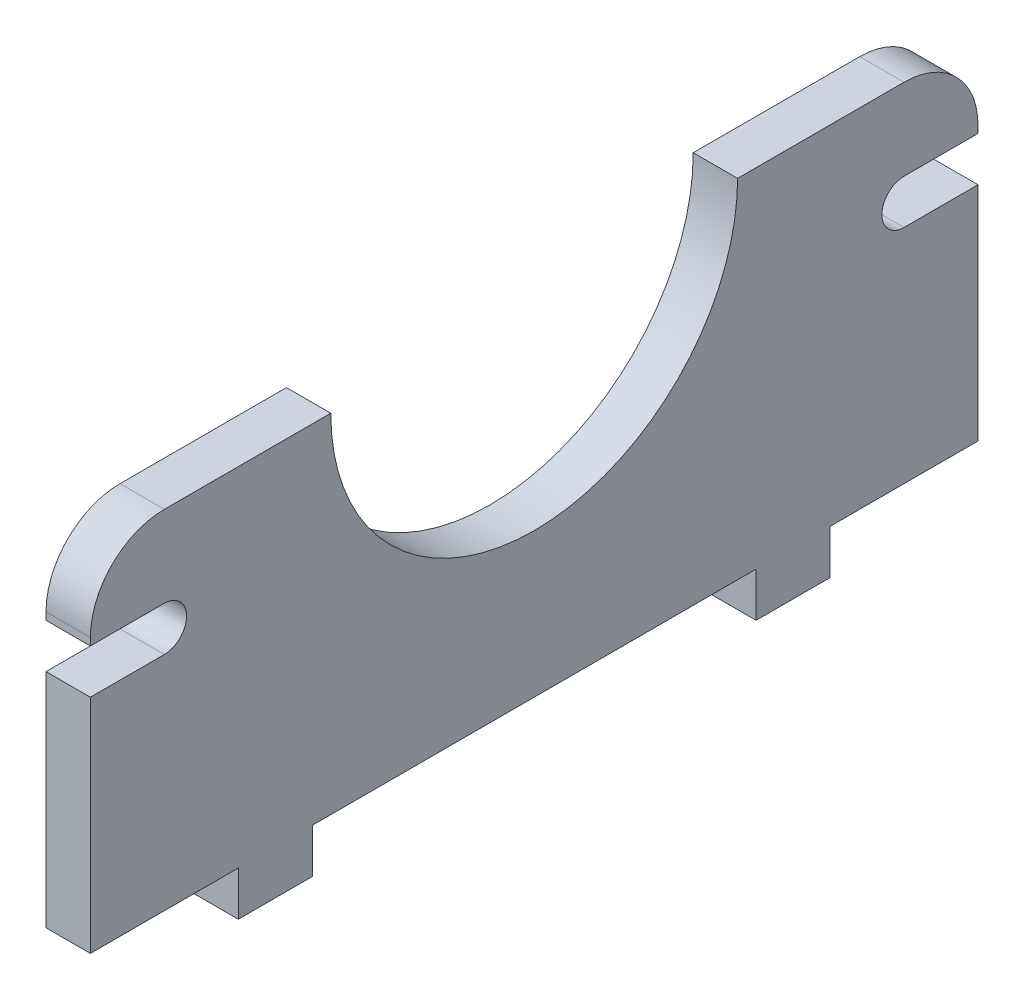
ISO-10303-21;
HEADER;
FILE_DESCRIPTION(('STEP AP214'),'2;1');
FILE_NAME('part.step','',(''),(''),'','','');
FILE_SCHEMA(('AUTOMOTIVE_DESIGN { 1 0 10303 214 1 1 1 1 }'));
ENDSEC;
DATA;
#1=APPLICATION_CONTEXT('core data for automotive mechanical design processes');
#2=APPLICATION_PROTOCOL_DEFINITION('international standard','automotive_design',2000,#1);
#3=PRODUCT_CONTEXT('',#1,'mechanical');
#4=PRODUCT('Part','Part','',(#3));
#5=PRODUCT_RELATED_PRODUCT_CATEGORY('part','',(#4));
#6=PRODUCT_DEFINITION_FORMATION('','',#4);
#7=PRODUCT_DEFINITION_CONTEXT('part definition',#1,'design');
#8=PRODUCT_DEFINITION('design','',#6,#7);
#9=PRODUCT_DEFINITION_SHAPE('','',#8);
#10=(LENGTH_UNIT() NAMED_UNIT(*) SI_UNIT(.MILLI.,.METRE.));
#11=(NAMED_UNIT(*) PLANE_ANGLE_UNIT() SI_UNIT($,.RADIAN.));
#12=(NAMED_UNIT(*) SI_UNIT($,.STERADIAN.) SOLID_ANGLE_UNIT());
#13=UNCERTAINTY_MEASURE_WITH_UNIT(LENGTH_MEASURE(1.E-05),#10,'distance_accuracy_value','');
#14=(GEOMETRIC_REPRESENTATION_CONTEXT(3) GLOBAL_UNCERTAINTY_ASSIGNED_CONTEXT((#13)) GLOBAL_UNIT_ASSIGNED_CONTEXT((#10,
#11,#12)) REPRESENTATION_CONTEXT('',''));
#15=CARTESIAN_POINT('',(0.,0.,0.));
#16=DIRECTION('',(0.,0.,1.));
#17=DIRECTION('',(1.,0.,0.));
#18=AXIS2_PLACEMENT_3D('',#15,#16,#17);
#19=CARTESIAN_POINT('',(3.,-11.75,-30.));
#20=DIRECTION('',(0.,1.,0.));
#21=DIRECTION('',(0.,0.,1.));
#22=AXIS2_PLACEMENT_3D('',#19,#20,#21);
#23=PLANE('',#22);
#24=DIRECTION('',(0.,0.,-1.));
#25=VECTOR('',#24,1.);
#26=CARTESIAN_POINT('',(0.,-11.75,-30.));
#27=LINE('',#26,#25);
#28=CARTESIAN_POINT('',(0.,-11.75,15.));
#29=VERTEX_POINT('',#28);
#30=CARTESIAN_POINT('',(0.,-11.75,-15.));
#31=VERTEX_POINT('',#30);
#32=EDGE_CURVE('E339',#29,#31,#27,.T.);
#33=ORIENTED_EDGE('',*,*,#32,.T.);
#34=DIRECTION('',(1.,0.,0.));
#35=VECTOR('',#34,1.);
#36=CARTESIAN_POINT('',(3.,-11.75,-15.));
#37=LINE('',#36,#35);
#38=CARTESIAN_POINT('',(3.,-11.75,-15.));
#39=VERTEX_POINT('',#38);
#40=EDGE_CURVE('E61',#31,#39,#37,.T.);
#41=ORIENTED_EDGE('',*,*,#40,.T.);
#42=DIRECTION('',(0.,0.,-1.));
#43=VECTOR('',#42,1.);
#44=CARTESIAN_POINT('',(3.,-11.75,-30.));
#45=LINE('',#44,#43);
#46=CARTESIAN_POINT('',(3.,-11.75,15.));
#47=VERTEX_POINT('',#46);
#48=EDGE_CURVE('E206',#47,#39,#45,.T.);
#49=ORIENTED_EDGE('',*,*,#48,.F.);
#50=DIRECTION('',(1.,0.,0.));
#51=VECTOR('',#50,1.);
#52=CARTESIAN_POINT('',(3.,-11.75,15.));
#53=LINE('',#52,#51);
#54=EDGE_CURVE('E241',#29,#47,#53,.T.);
#55=ORIENTED_EDGE('',*,*,#54,.F.);
#56=EDGE_LOOP('',(#33,#41,#49,#55));
#57=FACE_BOUND('',#56,.T.);
#58=ADVANCED_FACE('F38',(#57),#23,.F.);
#59=CARTESIAN_POINT('',(3.,-11.75,-20.));
#60=VERTEX_POINT('',#59);
#61=CARTESIAN_POINT('',(3.,-11.75,-30.));
#62=VERTEX_POINT('',#61);
#63=EDGE_CURVE('E53',#60,#62,#45,.T.);
#64=ORIENTED_EDGE('',*,*,#63,.F.);
#65=DIRECTION('',(-1.,0.,0.));
#66=VECTOR('',#65,1.);
#67=CARTESIAN_POINT('',(3.,-11.75,-20.));
#68=LINE('',#67,#66);
#69=CARTESIAN_POINT('',(0.,-11.75,-20.));
#70=VERTEX_POINT('',#69);
#71=EDGE_CURVE('E220',#60,#70,#68,.T.);
#72=ORIENTED_EDGE('',*,*,#71,.T.);
#73=CARTESIAN_POINT('',(0.,-11.75,-30.));
#74=VERTEX_POINT('',#73);
#75=EDGE_CURVE('E335',#70,#74,#27,.T.);
#76=ORIENTED_EDGE('',*,*,#75,.T.);
#77=DIRECTION('',(-1.,0.,0.));
#78=VECTOR('',#77,1.);
#79=CARTESIAN_POINT('',(3.,-11.75,-30.));
#80=LINE('',#79,#78);
#81=EDGE_CURVE('E355',#62,#74,#80,.T.);
#82=ORIENTED_EDGE('',*,*,#81,.F.);
#83=EDGE_LOOP('',(#64,#72,#76,#82));
#84=FACE_BOUND('',#83,.T.);
#85=ADVANCED_FACE('F432',(#84),#23,.F.);
#86=DIRECTION('',(-1.,0.,0.));
#87=VECTOR('',#86,1.);
#88=CARTESIAN_POINT('',(3.,-11.75,20.));
#89=LINE('',#88,#87);
#90=CARTESIAN_POINT('',(3.,-11.75,20.));
#91=VERTEX_POINT('',#90);
#92=CARTESIAN_POINT('',(0.,-11.75,20.));
#93=VERTEX_POINT('',#92);
#94=EDGE_CURVE('E209',#91,#93,#89,.T.);
#95=ORIENTED_EDGE('',*,*,#94,.F.);
#96=CARTESIAN_POINT('',(3.,-11.75,30.));
#97=VERTEX_POINT('',#96);
#98=EDGE_CURVE('E318',#97,#91,#45,.T.);
#99=ORIENTED_EDGE('',*,*,#98,.F.);
#100=DIRECTION('',(-1.,0.,0.));
#101=VECTOR('',#100,1.);
#102=CARTESIAN_POINT('',(3.,-11.75,30.));
#103=LINE('',#102,#101);
#104=CARTESIAN_POINT('',(0.,-11.75,30.));
#105=VERTEX_POINT('',#104);
#106=EDGE_CURVE('E358',#97,#105,#103,.T.);
#107=ORIENTED_EDGE('',*,*,#106,.T.);
#108=EDGE_CURVE('E336',#105,#93,#27,.T.);
#109=ORIENTED_EDGE('',*,*,#108,.T.);
#110=EDGE_LOOP('',(#95,#99,#107,#109));
#111=FACE_BOUND('',#110,.T.);
#112=ADVANCED_FACE('F449',(#111),#23,.F.);
#113=CARTESIAN_POINT('',(3.,-11.75,-30.));
#114=DIRECTION('',(0.,0.,1.));
#115=DIRECTION('',(1.,0.,0.));
#116=AXIS2_PLACEMENT_3D('',#113,#114,#115);
#117=PLANE('',#116);
#118=DIRECTION('',(0.,1.,0.));
#119=VECTOR('',#118,1.);
#120=CARTESIAN_POINT('',(0.,-11.75,-30.));
#121=LINE('',#120,#119);
#122=CARTESIAN_POINT('',(0.,6.25,-30.));
#123=VERTEX_POINT('',#122);
#124=CARTESIAN_POINT('',(0.,6.75,-30.));
#125=VERTEX_POINT('',#124);
#126=EDGE_CURVE('E338',#123,#125,#121,.T.);
#127=ORIENTED_EDGE('',*,*,#126,.T.);
#128=DIRECTION('',(-1.,0.,0.));
#129=VECTOR('',#128,1.);
#130=CARTESIAN_POINT('',(3.,6.75,-30.));
#131=LINE('',#130,#129);
#132=CARTESIAN_POINT('',(3.,6.75,-30.));
#133=VERTEX_POINT('',#132);
#134=EDGE_CURVE('E368',#125,#133,#131,.F.);
#135=ORIENTED_EDGE('',*,*,#134,.T.);
#136=DIRECTION('',(0.,1.,0.));
#137=VECTOR('',#136,1.);
#138=CARTESIAN_POINT('',(3.,-11.75,-30.));
#139=LINE('',#138,#137);
#140=CARTESIAN_POINT('',(3.,6.25,-30.));
#141=VERTEX_POINT('',#140);
#142=EDGE_CURVE('E321',#141,#133,#139,.T.);
#143=ORIENTED_EDGE('',*,*,#142,.F.);
#144=DIRECTION('',(1.,0.,0.));
#145=VECTOR('',#144,1.);
#146=CARTESIAN_POINT('',(0.,6.25,-30.));
#147=LINE('',#146,#145);
#148=EDGE_CURVE('E282',#123,#141,#147,.T.);
#149=ORIENTED_EDGE('',*,*,#148,.F.);
#150=EDGE_LOOP('',(#127,#135,#143,#149));
#151=FACE_BOUND('',#150,.T.);
#152=ADVANCED_FACE('F416',(#151),#117,.F.);
#153=DIRECTION('',(1.,0.,0.));
#154=VECTOR('',#153,1.);
#155=CARTESIAN_POINT('',(0.,3.25,-30.));
#156=LINE('',#155,#154);
#157=CARTESIAN_POINT('',(0.,3.25,-30.));
#158=VERTEX_POINT('',#157);
#159=CARTESIAN_POINT('',(3.,3.25,-30.));
#160=VERTEX_POINT('',#159);
#161=EDGE_CURVE('E284',#158,#160,#156,.T.);
#162=ORIENTED_EDGE('',*,*,#161,.T.);
#163=EDGE_CURVE('E322',#62,#160,#139,.T.);
#164=ORIENTED_EDGE('',*,*,#163,.F.);
#165=ORIENTED_EDGE('',*,*,#81,.T.);
#166=EDGE_CURVE('E340',#74,#158,#121,.T.);
#167=ORIENTED_EDGE('',*,*,#166,.T.);
#168=EDGE_LOOP('',(#162,#164,#165,#167));
#169=FACE_BOUND('',#168,.T.);
#170=ADVANCED_FACE('F430',(#169),#117,.F.);
#171=CARTESIAN_POINT('',(3.,11.75,0.));
#172=DIRECTION('',(1.,0.,0.));
#173=DIRECTION('',(0.,0.,-1.));
#174=AXIS2_PLACEMENT_3D('',#171,#172,#173);
#175=PLANE('',#174);
#176=ORIENTED_EDGE('',*,*,#142,.T.);
#177=CARTESIAN_POINT('',(3.,6.75,-25.));
#178=DIRECTION('',(1.,0.,0.));
#179=DIRECTION('',(0.,0.,-1.));
#180=AXIS2_PLACEMENT_3D('',#177,#178,#179);
#181=CIRCLE('',#180,5.);
#182=CARTESIAN_POINT('',(3.,11.75,-25.));
#183=VERTEX_POINT('',#182);
#184=EDGE_CURVE('E372',#133,#183,#181,.T.);
#185=ORIENTED_EDGE('',*,*,#184,.T.);
#186=DIRECTION('',(0.,0.,1.));
#187=VECTOR('',#186,1.);
#188=CARTESIAN_POINT('',(3.,11.75,-30.));
#189=LINE('',#188,#187);
#190=CARTESIAN_POINT('',(3.,11.75,-13.75));
#191=VERTEX_POINT('',#190);
#192=EDGE_CURVE('E325',#183,#191,#189,.T.);
#193=ORIENTED_EDGE('',*,*,#192,.T.);
#194=CARTESIAN_POINT('',(3.,11.75,0.));
#195=DIRECTION('',(-1.,0.,0.));
#196=DIRECTION('',(0.,0.,-1.));
#197=AXIS2_PLACEMENT_3D('',#194,#195,#196);
#198=CIRCLE('',#197,13.75);
#199=CARTESIAN_POINT('',(3.,11.75,13.75));
#200=VERTEX_POINT('',#199);
#201=EDGE_CURVE('E327',#191,#200,#198,.T.);
#202=ORIENTED_EDGE('',*,*,#201,.T.);
#203=DIRECTION('',(0.,0.,1.));
#204=VECTOR('',#203,1.);
#205=CARTESIAN_POINT('',(3.,11.75,13.75));
#206=LINE('',#205,#204);
#207=CARTESIAN_POINT('',(3.,11.75,25.));
#208=VERTEX_POINT('',#207);
#209=EDGE_CURVE('E329',#200,#208,#206,.T.);
#210=ORIENTED_EDGE('',*,*,#209,.T.);
#211=CARTESIAN_POINT('',(3.,6.75,25.));
#212=DIRECTION('',(1.,0.,0.));
#213=DIRECTION('',(0.,0.,-1.));
#214=AXIS2_PLACEMENT_3D('',#211,#212,#213);
#215=CIRCLE('',#214,5.);
#216=CARTESIAN_POINT('',(3.,6.75,30.));
#217=VERTEX_POINT('',#216);
#218=EDGE_CURVE('E370',#208,#217,#215,.T.);
#219=ORIENTED_EDGE('',*,*,#218,.T.);
#220=DIRECTION('',(0.,-1.,0.));
#221=VECTOR('',#220,1.);
#222=CARTESIAN_POINT('',(3.,-11.75,30.));
#223=LINE('',#222,#221);
#224=CARTESIAN_POINT('',(3.,6.25,30.));
#225=VERTEX_POINT('',#224);
#226=EDGE_CURVE('E315',#217,#225,#223,.T.);
#227=ORIENTED_EDGE('',*,*,#226,.T.);
#228=DIRECTION('',(0.,0.,1.));
#229=VECTOR('',#228,1.);
#230=CARTESIAN_POINT('',(3.,6.25,25.));
#231=LINE('',#230,#229);
#232=CARTESIAN_POINT('',(3.,6.25,25.));
#233=VERTEX_POINT('',#232);
#234=EDGE_CURVE('E301',#233,#225,#231,.T.);
#235=ORIENTED_EDGE('',*,*,#234,.F.);
#236=CARTESIAN_POINT('',(3.,4.75,25.));
#237=DIRECTION('',(1.,0.,0.));
#238=DIRECTION('',(0.,0.,-1.));
#239=AXIS2_PLACEMENT_3D('',#236,#237,#238);
#240=CIRCLE('',#239,1.5);
#241=CARTESIAN_POINT('',(3.,3.25,25.));
#242=VERTEX_POINT('',#241);
#243=EDGE_CURVE('E281',#242,#233,#240,.T.);
#244=ORIENTED_EDGE('',*,*,#243,.F.);
#245=DIRECTION('',(0.,0.,-1.));
#246=VECTOR('',#245,1.);
#247=CARTESIAN_POINT('',(3.,3.25,25.));
#248=LINE('',#247,#246);
#249=CARTESIAN_POINT('',(3.,3.25,30.));
#250=VERTEX_POINT('',#249);
#251=EDGE_CURVE('E292',#250,#242,#248,.T.);
#252=ORIENTED_EDGE('',*,*,#251,.F.);
#253=EDGE_CURVE('E317',#250,#97,#223,.T.);
#254=ORIENTED_EDGE('',*,*,#253,.T.);
#255=ORIENTED_EDGE('',*,*,#98,.T.);
#256=DIRECTION('',(0.,1.,0.));
#257=VECTOR('',#256,1.);
#258=CARTESIAN_POINT('',(3.,-14.75,20.));
#259=LINE('',#258,#257);
#260=CARTESIAN_POINT('',(3.,-14.75,20.));
#261=VERTEX_POINT('',#260);
#262=EDGE_CURVE('E259',#261,#91,#259,.T.);
#263=ORIENTED_EDGE('',*,*,#262,.F.);
#264=DIRECTION('',(0.,0.,1.));
#265=VECTOR('',#264,1.);
#266=CARTESIAN_POINT('',(3.,-14.75,20.));
#267=LINE('',#266,#265);
#268=CARTESIAN_POINT('',(3.,-14.75,15.));
#269=VERTEX_POINT('',#268);
#270=EDGE_CURVE('E237',#269,#261,#267,.T.);
#271=ORIENTED_EDGE('',*,*,#270,.F.);
#272=DIRECTION('',(0.,1.,0.));
#273=VECTOR('',#272,1.);
#274=CARTESIAN_POINT('',(3.,-14.75,15.));
#275=LINE('',#274,#273);
#276=EDGE_CURVE('E247',#269,#47,#275,.T.);
#277=ORIENTED_EDGE('',*,*,#276,.T.);
#278=ORIENTED_EDGE('',*,*,#48,.T.);
#279=DIRECTION('',(0.,1.,0.));
#280=VECTOR('',#279,1.);
#281=CARTESIAN_POINT('',(3.,-14.75,-15.));
#282=LINE('',#281,#280);
#283=CARTESIAN_POINT('',(3.,-14.75,-15.));
#284=VERTEX_POINT('',#283);
#285=EDGE_CURVE('E199',#284,#39,#282,.T.);
#286=ORIENTED_EDGE('',*,*,#285,.F.);
#287=DIRECTION('',(0.,0.,-1.));
#288=VECTOR('',#287,1.);
#289=CARTESIAN_POINT('',(3.,-14.75,-20.));
#290=LINE('',#289,#288);
#291=CARTESIAN_POINT('',(3.,-14.75,-20.));
#292=VERTEX_POINT('',#291);
#293=EDGE_CURVE('E203',#284,#292,#290,.T.);
#294=ORIENTED_EDGE('',*,*,#293,.T.);
#295=DIRECTION('',(0.,1.,0.));
#296=VECTOR('',#295,1.);
#297=CARTESIAN_POINT('',(3.,-14.75,-20.));
#298=LINE('',#297,#296);
#299=EDGE_CURVE('E229',#292,#60,#298,.T.);
#300=ORIENTED_EDGE('',*,*,#299,.T.);
#301=ORIENTED_EDGE('',*,*,#63,.T.);
#302=ORIENTED_EDGE('',*,*,#163,.T.);
#303=DIRECTION('',(0.,0.,1.));
#304=VECTOR('',#303,1.);
#305=CARTESIAN_POINT('',(3.,3.25,-25.));
#306=LINE('',#305,#304);
#307=CARTESIAN_POINT('',(3.,3.25,-25.));
#308=VERTEX_POINT('',#307);
#309=EDGE_CURVE('E273',#160,#308,#306,.T.);
#310=ORIENTED_EDGE('',*,*,#309,.T.);
#311=CARTESIAN_POINT('',(3.,4.75,-25.));
#312=DIRECTION('',(-1.,0.,0.));
#313=DIRECTION('',(0.,0.,1.));
#314=AXIS2_PLACEMENT_3D('',#311,#312,#313);
#315=CIRCLE('',#314,1.5);
#316=CARTESIAN_POINT('',(3.,6.25,-25.));
#317=VERTEX_POINT('',#316);
#318=EDGE_CURVE('E262',#308,#317,#315,.T.);
#319=ORIENTED_EDGE('',*,*,#318,.T.);
#320=DIRECTION('',(0.,0.,-1.));
#321=VECTOR('',#320,1.);
#322=CARTESIAN_POINT('',(3.,6.25,-25.));
#323=LINE('',#322,#321);
#324=EDGE_CURVE('E266',#317,#141,#323,.T.);
#325=ORIENTED_EDGE('',*,*,#324,.T.);
#326=EDGE_LOOP('',(#176,#185,#193,#202,#210,#219,#227,#235,#244,#252,#254,#255,#263,#271,#277,
#278,#286,#294,#300,#301,#302,#310,#319,#325));
#327=FACE_BOUND('',#326,.T.);
#328=ADVANCED_FACE('F202',(#327),#175,.T.);
#329=CARTESIAN_POINT('',(0.,11.75,0.));
#330=DIRECTION('',(1.,0.,0.));
#331=DIRECTION('',(0.,0.,-1.));
#332=AXIS2_PLACEMENT_3D('',#329,#330,#331);
#333=PLANE('',#332);
#334=DIRECTION('',(0.,0.,1.));
#335=VECTOR('',#334,1.);
#336=CARTESIAN_POINT('',(0.,11.75,-30.));
#337=LINE('',#336,#335);
#338=CARTESIAN_POINT('',(0.,11.75,-25.));
#339=VERTEX_POINT('',#338);
#340=CARTESIAN_POINT('',(0.,11.75,-13.75));
#341=VERTEX_POINT('',#340);
#342=EDGE_CURVE('E343',#339,#341,#337,.T.);
#343=ORIENTED_EDGE('',*,*,#342,.F.);
#344=CARTESIAN_POINT('',(0.,6.75,-25.));
#345=DIRECTION('',(1.,0.,0.));
#346=DIRECTION('',(0.,0.,-1.));
#347=AXIS2_PLACEMENT_3D('',#344,#345,#346);
#348=CIRCLE('',#347,5.);
#349=EDGE_CURVE('E366',#339,#125,#348,.F.);
#350=ORIENTED_EDGE('',*,*,#349,.T.);
#351=ORIENTED_EDGE('',*,*,#126,.F.);
#352=DIRECTION('',(0.,0.,-1.));
#353=VECTOR('',#352,1.);
#354=CARTESIAN_POINT('',(0.,6.25,-25.));
#355=LINE('',#354,#353);
#356=CARTESIAN_POINT('',(0.,6.25,-25.));
#357=VERTEX_POINT('',#356);
#358=EDGE_CURVE('E268',#357,#123,#355,.T.);
#359=ORIENTED_EDGE('',*,*,#358,.F.);
#360=CARTESIAN_POINT('',(0.,4.75,-25.));
#361=DIRECTION('',(-1.,0.,0.));
#362=DIRECTION('',(0.,0.,1.));
#363=AXIS2_PLACEMENT_3D('',#360,#361,#362);
#364=CIRCLE('',#363,1.5);
#365=CARTESIAN_POINT('',(0.,3.25,-25.));
#366=VERTEX_POINT('',#365);
#367=EDGE_CURVE('E263',#366,#357,#364,.T.);
#368=ORIENTED_EDGE('',*,*,#367,.F.);
#369=DIRECTION('',(0.,0.,1.));
#370=VECTOR('',#369,1.);
#371=CARTESIAN_POINT('',(0.,3.25,-25.));
#372=LINE('',#371,#370);
#373=EDGE_CURVE('E265',#158,#366,#372,.T.);
#374=ORIENTED_EDGE('',*,*,#373,.F.);
#375=ORIENTED_EDGE('',*,*,#166,.F.);
#376=ORIENTED_EDGE('',*,*,#75,.F.);
#377=DIRECTION('',(0.,1.,0.));
#378=VECTOR('',#377,1.);
#379=CARTESIAN_POINT('',(0.,-14.75,-20.));
#380=LINE('',#379,#378);
#381=CARTESIAN_POINT('',(0.,-14.75,-20.));
#382=VERTEX_POINT('',#381);
#383=EDGE_CURVE('E233',#382,#70,#380,.T.);
#384=ORIENTED_EDGE('',*,*,#383,.F.);
#385=DIRECTION('',(0.,0.,1.));
#386=VECTOR('',#385,1.);
#387=CARTESIAN_POINT('',(0.,-14.75,-20.));
#388=LINE('',#387,#386);
#389=CARTESIAN_POINT('',(0.,-14.75,-15.));
#390=VERTEX_POINT('',#389);
#391=EDGE_CURVE('E224',#382,#390,#388,.T.);
#392=ORIENTED_EDGE('',*,*,#391,.T.);
#393=DIRECTION('',(0.,1.,0.));
#394=VECTOR('',#393,1.);
#395=CARTESIAN_POINT('',(0.,-14.75,-15.));
#396=LINE('',#395,#394);
#397=EDGE_CURVE('E210',#390,#31,#396,.T.);
#398=ORIENTED_EDGE('',*,*,#397,.T.);
#399=ORIENTED_EDGE('',*,*,#32,.F.);
#400=DIRECTION('',(0.,1.,0.));
#401=VECTOR('',#400,1.);
#402=CARTESIAN_POINT('',(0.,-14.75,15.));
#403=LINE('',#402,#401);
#404=CARTESIAN_POINT('',(0.,-14.75,15.));
#405=VERTEX_POINT('',#404);
#406=EDGE_CURVE('E253',#405,#29,#403,.T.);
#407=ORIENTED_EDGE('',*,*,#406,.F.);
#408=DIRECTION('',(0.,0.,-1.));
#409=VECTOR('',#408,1.);
#410=CARTESIAN_POINT('',(0.,-14.75,20.));
#411=LINE('',#410,#409);
#412=CARTESIAN_POINT('',(0.,-14.75,20.));
#413=VERTEX_POINT('',#412);
#414=EDGE_CURVE('E243',#413,#405,#411,.T.);
#415=ORIENTED_EDGE('',*,*,#414,.F.);
#416=DIRECTION('',(0.,1.,0.));
#417=VECTOR('',#416,1.);
#418=CARTESIAN_POINT('',(0.,-14.75,20.));
#419=LINE('',#418,#417);
#420=EDGE_CURVE('E256',#413,#93,#419,.T.);
#421=ORIENTED_EDGE('',*,*,#420,.T.);
#422=ORIENTED_EDGE('',*,*,#108,.F.);
#423=DIRECTION('',(0.,-1.,0.));
#424=VECTOR('',#423,1.);
#425=CARTESIAN_POINT('',(0.,-11.75,30.));
#426=LINE('',#425,#424);
#427=CARTESIAN_POINT('',(0.,3.25,30.));
#428=VERTEX_POINT('',#427);
#429=EDGE_CURVE('E308',#428,#105,#426,.T.);
#430=ORIENTED_EDGE('',*,*,#429,.F.);
#431=DIRECTION('',(0.,0.,-1.));
#432=VECTOR('',#431,1.);
#433=CARTESIAN_POINT('',(0.,3.25,25.));
#434=LINE('',#433,#432);
#435=CARTESIAN_POINT('',(0.,3.25,25.));
#436=VERTEX_POINT('',#435);
#437=EDGE_CURVE('E295',#428,#436,#434,.T.);
#438=ORIENTED_EDGE('',*,*,#437,.T.);
#439=CARTESIAN_POINT('',(0.,4.75,25.));
#440=DIRECTION('',(1.,0.,0.));
#441=DIRECTION('',(0.,0.,-1.));
#442=AXIS2_PLACEMENT_3D('',#439,#440,#441);
#443=CIRCLE('',#442,1.5);
#444=CARTESIAN_POINT('',(0.,6.25,25.));
#445=VERTEX_POINT('',#444);
#446=EDGE_CURVE('E288',#436,#445,#443,.T.);
#447=ORIENTED_EDGE('',*,*,#446,.T.);
#448=DIRECTION('',(0.,0.,1.));
#449=VECTOR('',#448,1.);
#450=CARTESIAN_POINT('',(0.,6.25,25.));
#451=LINE('',#450,#449);
#452=CARTESIAN_POINT('',(0.,6.25,30.));
#453=VERTEX_POINT('',#452);
#454=EDGE_CURVE('E291',#445,#453,#451,.T.);
#455=ORIENTED_EDGE('',*,*,#454,.T.);
#456=CARTESIAN_POINT('',(0.,6.75,30.));
#457=VERTEX_POINT('',#456);
#458=EDGE_CURVE('E333',#457,#453,#426,.T.);
#459=ORIENTED_EDGE('',*,*,#458,.F.);
#460=CARTESIAN_POINT('',(0.,6.75,25.));
#461=DIRECTION('',(1.,0.,0.));
#462=DIRECTION('',(0.,0.,-1.));
#463=AXIS2_PLACEMENT_3D('',#460,#461,#462);
#464=CIRCLE('',#463,5.);
#465=CARTESIAN_POINT('',(0.,11.75,25.));
#466=VERTEX_POINT('',#465);
#467=EDGE_CURVE('E364',#457,#466,#464,.F.);
#468=ORIENTED_EDGE('',*,*,#467,.T.);
#469=DIRECTION('',(0.,0.,1.));
#470=VECTOR('',#469,1.);
#471=CARTESIAN_POINT('',(0.,11.75,13.75));
#472=LINE('',#471,#470);
#473=CARTESIAN_POINT('',(0.,11.75,13.75));
#474=VERTEX_POINT('',#473);
#475=EDGE_CURVE('E347',#474,#466,#472,.T.);
#476=ORIENTED_EDGE('',*,*,#475,.F.);
#477=CARTESIAN_POINT('',(0.,11.75,0.));
#478=DIRECTION('',(-1.,0.,0.));
#479=DIRECTION('',(0.,0.,-1.));
#480=AXIS2_PLACEMENT_3D('',#477,#478,#479);
#481=CIRCLE('',#480,13.75);
#482=EDGE_CURVE('E345',#341,#474,#481,.T.);
#483=ORIENTED_EDGE('',*,*,#482,.F.);
#484=EDGE_LOOP('',(#343,#350,#351,#359,#368,#374,#375,#376,#384,#392,#398,#399,#407,#415,#421,
#422,#430,#438,#447,#455,#459,#468,#476,#483));
#485=FACE_BOUND('',#484,.T.);
#486=ADVANCED_FACE('F384',(#485),#333,.F.);
#487=CARTESIAN_POINT('',(3.,-11.75,30.));
#488=DIRECTION('',(0.,0.,-1.));
#489=DIRECTION('',(0.,1.,0.));
#490=AXIS2_PLACEMENT_3D('',#487,#488,#489);
#491=PLANE('',#490);
#492=ORIENTED_EDGE('',*,*,#253,.F.);
#493=DIRECTION('',(1.,0.,0.));
#494=VECTOR('',#493,1.);
#495=CARTESIAN_POINT('',(0.,3.25,30.));
#496=LINE('',#495,#494);
#497=EDGE_CURVE('E309',#428,#250,#496,.T.);
#498=ORIENTED_EDGE('',*,*,#497,.F.);
#499=ORIENTED_EDGE('',*,*,#429,.T.);
#500=ORIENTED_EDGE('',*,*,#106,.F.);
#501=EDGE_LOOP('',(#492,#498,#499,#500));
#502=FACE_BOUND('',#501,.T.);
#503=ADVANCED_FACE('F477',(#502),#491,.F.);
#504=ORIENTED_EDGE('',*,*,#226,.F.);
#505=DIRECTION('',(-1.,0.,0.));
#506=VECTOR('',#505,1.);
#507=CARTESIAN_POINT('',(3.,6.75,30.));
#508=LINE('',#507,#506);
#509=EDGE_CURVE('E46',#217,#457,#508,.T.);
#510=ORIENTED_EDGE('',*,*,#509,.T.);
#511=ORIENTED_EDGE('',*,*,#458,.T.);
#512=DIRECTION('',(1.,0.,0.));
#513=VECTOR('',#512,1.);
#514=CARTESIAN_POINT('',(0.,6.25,30.));
#515=LINE('',#514,#513);
#516=EDGE_CURVE('E311',#453,#225,#515,.T.);
#517=ORIENTED_EDGE('',*,*,#516,.T.);
#518=EDGE_LOOP('',(#504,#510,#511,#517));
#519=FACE_BOUND('',#518,.T.);
#520=ADVANCED_FACE('F378',(#519),#491,.F.);
#521=CARTESIAN_POINT('',(3.,11.75,-30.));
#522=DIRECTION('',(0.,-1.,0.));
#523=DIRECTION('',(0.,0.,-1.));
#524=AXIS2_PLACEMENT_3D('',#521,#522,#523);
#525=PLANE('',#524);
#526=ORIENTED_EDGE('',*,*,#192,.F.);
#527=DIRECTION('',(-1.,0.,0.));
#528=VECTOR('',#527,1.);
#529=CARTESIAN_POINT('',(3.,11.75,-25.));
#530=LINE('',#529,#528);
#531=EDGE_CURVE('E361',#183,#339,#530,.T.);
#532=ORIENTED_EDGE('',*,*,#531,.T.);
#533=ORIENTED_EDGE('',*,*,#342,.T.);
#534=DIRECTION('',(-1.,0.,0.));
#535=VECTOR('',#534,1.);
#536=CARTESIAN_POINT('',(3.,11.75,-13.75));
#537=LINE('',#536,#535);
#538=EDGE_CURVE('E352',#191,#341,#537,.T.);
#539=ORIENTED_EDGE('',*,*,#538,.F.);
#540=EDGE_LOOP('',(#526,#532,#533,#539));
#541=FACE_BOUND('',#540,.T.);
#542=ADVANCED_FACE('F405',(#541),#525,.F.);
#543=CARTESIAN_POINT('',(3.,11.75,0.));
#544=DIRECTION('',(-1.,0.,0.));
#545=DIRECTION('',(0.,0.,1.));
#546=AXIS2_PLACEMENT_3D('',#543,#544,#545);
#547=CYLINDRICAL_SURFACE('',#546,13.75);
#548=ORIENTED_EDGE('',*,*,#482,.T.);
#549=DIRECTION('',(-1.,0.,0.));
#550=VECTOR('',#549,1.);
#551=CARTESIAN_POINT('',(3.,11.75,13.75));
#552=LINE('',#551,#550);
#553=EDGE_CURVE('E332',#200,#474,#552,.T.);
#554=ORIENTED_EDGE('',*,*,#553,.F.);
#555=ORIENTED_EDGE('',*,*,#201,.F.);
#556=ORIENTED_EDGE('',*,*,#538,.T.);
#557=EDGE_LOOP('',(#548,#554,#555,#556));
#558=FACE_BOUND('',#557,.T.);
#559=ADVANCED_FACE('F400',(#558),#547,.F.);
#560=CARTESIAN_POINT('',(3.,11.75,13.75));
#561=DIRECTION('',(0.,-1.,0.));
#562=DIRECTION('',(0.,0.,-1.));
#563=AXIS2_PLACEMENT_3D('',#560,#561,#562);
#564=PLANE('',#563);
#565=ORIENTED_EDGE('',*,*,#475,.T.);
#566=DIRECTION('',(-1.,0.,0.));
#567=VECTOR('',#566,1.);
#568=CARTESIAN_POINT('',(3.,11.75,25.));
#569=LINE('',#568,#567);
#570=EDGE_CURVE('E11',#466,#208,#569,.F.);
#571=ORIENTED_EDGE('',*,*,#570,.T.);
#572=ORIENTED_EDGE('',*,*,#209,.F.);
#573=ORIENTED_EDGE('',*,*,#553,.T.);
#574=EDGE_LOOP('',(#565,#571,#572,#573));
#575=FACE_BOUND('',#574,.T.);
#576=ADVANCED_FACE('F396',(#575),#564,.F.);
#577=CARTESIAN_POINT('',(0.,4.75,25.));
#578=DIRECTION('',(1.,0.,0.));
#579=DIRECTION('',(0.,0.,-1.));
#580=AXIS2_PLACEMENT_3D('',#577,#578,#579);
#581=CYLINDRICAL_SURFACE('',#580,1.5);
#582=ORIENTED_EDGE('',*,*,#243,.T.);
#583=DIRECTION('',(1.,0.,0.));
#584=VECTOR('',#583,1.);
#585=CARTESIAN_POINT('',(0.,6.25,25.));
#586=LINE('',#585,#584);
#587=EDGE_CURVE('E298',#445,#233,#586,.T.);
#588=ORIENTED_EDGE('',*,*,#587,.F.);
#589=ORIENTED_EDGE('',*,*,#446,.F.);
#590=DIRECTION('',(1.,0.,0.));
#591=VECTOR('',#590,1.);
#592=CARTESIAN_POINT('',(0.,3.25,25.));
#593=LINE('',#592,#591);
#594=EDGE_CURVE('E306',#436,#242,#593,.T.);
#595=ORIENTED_EDGE('',*,*,#594,.T.);
#596=EDGE_LOOP('',(#582,#588,#589,#595));
#597=FACE_BOUND('',#596,.T.);
#598=ADVANCED_FACE('F482',(#597),#581,.F.);
#599=CARTESIAN_POINT('',(0.,3.25,25.));
#600=DIRECTION('',(0.,-1.,0.));
#601=DIRECTION('',(0.,0.,-1.));
#602=AXIS2_PLACEMENT_3D('',#599,#600,#601);
#603=PLANE('',#602);
#604=ORIENTED_EDGE('',*,*,#251,.T.);
#605=ORIENTED_EDGE('',*,*,#594,.F.);
#606=ORIENTED_EDGE('',*,*,#437,.F.);
#607=ORIENTED_EDGE('',*,*,#497,.T.);
#608=EDGE_LOOP('',(#604,#605,#606,#607));
#609=FACE_BOUND('',#608,.T.);
#610=ADVANCED_FACE('F480',(#609),#603,.F.);
#611=CARTESIAN_POINT('',(0.,6.25,25.));
#612=DIRECTION('',(0.,1.,0.));
#613=DIRECTION('',(0.,0.,1.));
#614=AXIS2_PLACEMENT_3D('',#611,#612,#613);
#615=PLANE('',#614);
#616=ORIENTED_EDGE('',*,*,#234,.T.);
#617=ORIENTED_EDGE('',*,*,#516,.F.);
#618=ORIENTED_EDGE('',*,*,#454,.F.);
#619=ORIENTED_EDGE('',*,*,#587,.T.);
#620=EDGE_LOOP('',(#616,#617,#618,#619));
#621=FACE_BOUND('',#620,.T.);
#622=ADVANCED_FACE('F389',(#621),#615,.F.);
#623=CARTESIAN_POINT('',(0.,4.75,-25.));
#624=DIRECTION('',(1.,0.,0.));
#625=DIRECTION('',(0.,0.,-1.));
#626=AXIS2_PLACEMENT_3D('',#623,#624,#625);
#627=CYLINDRICAL_SURFACE('',#626,1.5);
#628=ORIENTED_EDGE('',*,*,#318,.F.);
#629=DIRECTION('',(1.,0.,0.));
#630=VECTOR('',#629,1.);
#631=CARTESIAN_POINT('',(0.,3.25,-25.));
#632=LINE('',#631,#630);
#633=EDGE_CURVE('E270',#366,#308,#632,.T.);
#634=ORIENTED_EDGE('',*,*,#633,.F.);
#635=ORIENTED_EDGE('',*,*,#367,.T.);
#636=DIRECTION('',(1.,0.,0.));
#637=VECTOR('',#636,1.);
#638=CARTESIAN_POINT('',(0.,6.25,-25.));
#639=LINE('',#638,#637);
#640=EDGE_CURVE('E278',#357,#317,#639,.T.);
#641=ORIENTED_EDGE('',*,*,#640,.T.);
#642=EDGE_LOOP('',(#628,#634,#635,#641));
#643=FACE_BOUND('',#642,.T.);
#644=ADVANCED_FACE('F424',(#643),#627,.F.);
#645=CARTESIAN_POINT('',(0.,6.25,-25.));
#646=DIRECTION('',(0.,-1.,0.));
#647=DIRECTION('',(0.,0.,-1.));
#648=AXIS2_PLACEMENT_3D('',#645,#646,#647);
#649=PLANE('',#648);
#650=ORIENTED_EDGE('',*,*,#324,.F.);
#651=ORIENTED_EDGE('',*,*,#640,.F.);
#652=ORIENTED_EDGE('',*,*,#358,.T.);
#653=ORIENTED_EDGE('',*,*,#148,.T.);
#654=EDGE_LOOP('',(#650,#651,#652,#653));
#655=FACE_BOUND('',#654,.T.);
#656=ADVANCED_FACE('F419',(#655),#649,.T.);
#657=CARTESIAN_POINT('',(0.,3.25,-25.));
#658=DIRECTION('',(0.,1.,0.));
#659=DIRECTION('',(0.,0.,1.));
#660=AXIS2_PLACEMENT_3D('',#657,#658,#659);
#661=PLANE('',#660);
#662=ORIENTED_EDGE('',*,*,#309,.F.);
#663=ORIENTED_EDGE('',*,*,#161,.F.);
#664=ORIENTED_EDGE('',*,*,#373,.T.);
#665=ORIENTED_EDGE('',*,*,#633,.T.);
#666=EDGE_LOOP('',(#662,#663,#664,#665));
#667=FACE_BOUND('',#666,.T.);
#668=ADVANCED_FACE('F507',(#667),#661,.T.);
#669=CARTESIAN_POINT('',(3.,6.75,-25.));
#670=DIRECTION('',(-1.,0.,0.));
#671=DIRECTION('',(0.,0.,1.));
#672=AXIS2_PLACEMENT_3D('',#669,#670,#671);
#673=CYLINDRICAL_SURFACE('',#672,5.);
#674=ORIENTED_EDGE('',*,*,#184,.F.);
#675=ORIENTED_EDGE('',*,*,#134,.F.);
#676=ORIENTED_EDGE('',*,*,#349,.F.);
#677=ORIENTED_EDGE('',*,*,#531,.F.);
#678=EDGE_LOOP('',(#674,#675,#676,#677));
#679=FACE_BOUND('',#678,.T.);
#680=ADVANCED_FACE('F409',(#679),#673,.T.);
#681=CARTESIAN_POINT('',(3.,6.75,25.));
#682=DIRECTION('',(-1.,0.,0.));
#683=DIRECTION('',(0.,0.,1.));
#684=AXIS2_PLACEMENT_3D('',#681,#682,#683);
#685=CYLINDRICAL_SURFACE('',#684,5.);
#686=ORIENTED_EDGE('',*,*,#218,.F.);
#687=ORIENTED_EDGE('',*,*,#570,.F.);
#688=ORIENTED_EDGE('',*,*,#467,.F.);
#689=ORIENTED_EDGE('',*,*,#509,.F.);
#690=EDGE_LOOP('',(#686,#687,#688,#689));
#691=FACE_BOUND('',#690,.T.);
#692=ADVANCED_FACE('F40',(#691),#685,.T.);
#693=CARTESIAN_POINT('',(3.,-14.75,20.));
#694=DIRECTION('',(0.,0.,-1.));
#695=DIRECTION('',(0.,1.,0.));
#696=AXIS2_PLACEMENT_3D('',#693,#694,#695);
#697=PLANE('',#696);
#698=ORIENTED_EDGE('',*,*,#94,.T.);
#699=ORIENTED_EDGE('',*,*,#420,.F.);
#700=DIRECTION('',(-1.,0.,0.));
#701=VECTOR('',#700,1.);
#702=CARTESIAN_POINT('',(3.,-14.75,20.));
#703=LINE('',#702,#701);
#704=EDGE_CURVE('E240',#261,#413,#703,.T.);
#705=ORIENTED_EDGE('',*,*,#704,.F.);
#706=ORIENTED_EDGE('',*,*,#262,.T.);
#707=EDGE_LOOP('',(#698,#699,#705,#706));
#708=FACE_BOUND('',#707,.T.);
#709=ADVANCED_FACE('F468',(#708),#697,.F.);
#710=CARTESIAN_POINT('',(3.,-14.75,15.));
#711=DIRECTION('',(0.,0.,1.));
#712=DIRECTION('',(0.,-1.,0.));
#713=AXIS2_PLACEMENT_3D('',#710,#711,#712);
#714=PLANE('',#713);
#715=ORIENTED_EDGE('',*,*,#54,.T.);
#716=ORIENTED_EDGE('',*,*,#276,.F.);
#717=DIRECTION('',(1.,0.,0.));
#718=VECTOR('',#717,1.);
#719=CARTESIAN_POINT('',(3.,-14.75,15.));
#720=LINE('',#719,#718);
#721=EDGE_CURVE('E245',#405,#269,#720,.T.);
#722=ORIENTED_EDGE('',*,*,#721,.F.);
#723=ORIENTED_EDGE('',*,*,#406,.T.);
#724=EDGE_LOOP('',(#715,#716,#722,#723));
#725=FACE_BOUND('',#724,.T.);
#726=ADVANCED_FACE('F474',(#725),#714,.F.);
#727=CARTESIAN_POINT('',(0.,-14.75,0.));
#728=DIRECTION('',(0.,1.,0.));
#729=DIRECTION('',(0.,0.,1.));
#730=AXIS2_PLACEMENT_3D('',#727,#728,#729);
#731=PLANE('',#730);
#732=ORIENTED_EDGE('',*,*,#270,.T.);
#733=ORIENTED_EDGE('',*,*,#704,.T.);
#734=ORIENTED_EDGE('',*,*,#414,.T.);
#735=ORIENTED_EDGE('',*,*,#721,.T.);
#736=EDGE_LOOP('',(#732,#733,#734,#735));
#737=FACE_BOUND('',#736,.T.);
#738=ADVANCED_FACE('F445',(#737),#731,.F.);
#739=CARTESIAN_POINT('',(3.,-14.75,-15.));
#740=DIRECTION('',(0.,0.,1.));
#741=DIRECTION('',(0.,-1.,0.));
#742=AXIS2_PLACEMENT_3D('',#739,#740,#741);
#743=PLANE('',#742);
#744=ORIENTED_EDGE('',*,*,#40,.F.);
#745=ORIENTED_EDGE('',*,*,#397,.F.);
#746=DIRECTION('',(1.,0.,0.));
#747=VECTOR('',#746,1.);
#748=CARTESIAN_POINT('',(3.,-14.75,-15.));
#749=LINE('',#748,#747);
#750=EDGE_CURVE('E216',#390,#284,#749,.T.);
#751=ORIENTED_EDGE('',*,*,#750,.T.);
#752=ORIENTED_EDGE('',*,*,#285,.T.);
#753=EDGE_LOOP('',(#744,#745,#751,#752));
#754=FACE_BOUND('',#753,.T.);
#755=ADVANCED_FACE('F222',(#754),#743,.T.);
#756=CARTESIAN_POINT('',(3.,-14.75,-20.));
#757=DIRECTION('',(0.,0.,-1.));
#758=DIRECTION('',(0.,1.,0.));
#759=AXIS2_PLACEMENT_3D('',#756,#757,#758);
#760=PLANE('',#759);
#761=ORIENTED_EDGE('',*,*,#71,.F.);
#762=ORIENTED_EDGE('',*,*,#299,.F.);
#763=DIRECTION('',(-1.,0.,0.));
#764=VECTOR('',#763,1.);
#765=CARTESIAN_POINT('',(3.,-14.75,-20.));
#766=LINE('',#765,#764);
#767=EDGE_CURVE('E219',#292,#382,#766,.T.);
#768=ORIENTED_EDGE('',*,*,#767,.T.);
#769=ORIENTED_EDGE('',*,*,#383,.T.);
#770=EDGE_LOOP('',(#761,#762,#768,#769));
#771=FACE_BOUND('',#770,.T.);
#772=ADVANCED_FACE('F437',(#771),#760,.T.);
#773=CARTESIAN_POINT('',(0.,-14.75,0.));
#774=DIRECTION('',(0.,1.,0.));
#775=DIRECTION('',(0.,0.,-1.));
#776=AXIS2_PLACEMENT_3D('',#773,#774,#775);
#777=PLANE('',#776);
#778=ORIENTED_EDGE('',*,*,#293,.F.);
#779=ORIENTED_EDGE('',*,*,#750,.F.);
#780=ORIENTED_EDGE('',*,*,#391,.F.);
#781=ORIENTED_EDGE('',*,*,#767,.F.);
#782=EDGE_LOOP('',(#778,#779,#780,#781));
#783=FACE_BOUND('',#782,.T.);
#784=ADVANCED_FACE('F214',(#783),#777,.F.);
#785=CLOSED_SHELL('',(#58,#85,#112,#152,#170,#328,#486,#503,#520,#542,#559,#576,#598,#610,#622,
#644,#656,#668,#680,#692,#709,#726,#738,#755,#772,#784));
#786=MANIFOLD_SOLID_BREP('B2',#785);
#787=ADVANCED_BREP_SHAPE_REPRESENTATION('',(#18,#786),#14);
#788=SHAPE_DEFINITION_REPRESENTATION(#9,#787);
ENDSEC;
END-ISO-10303-21;
